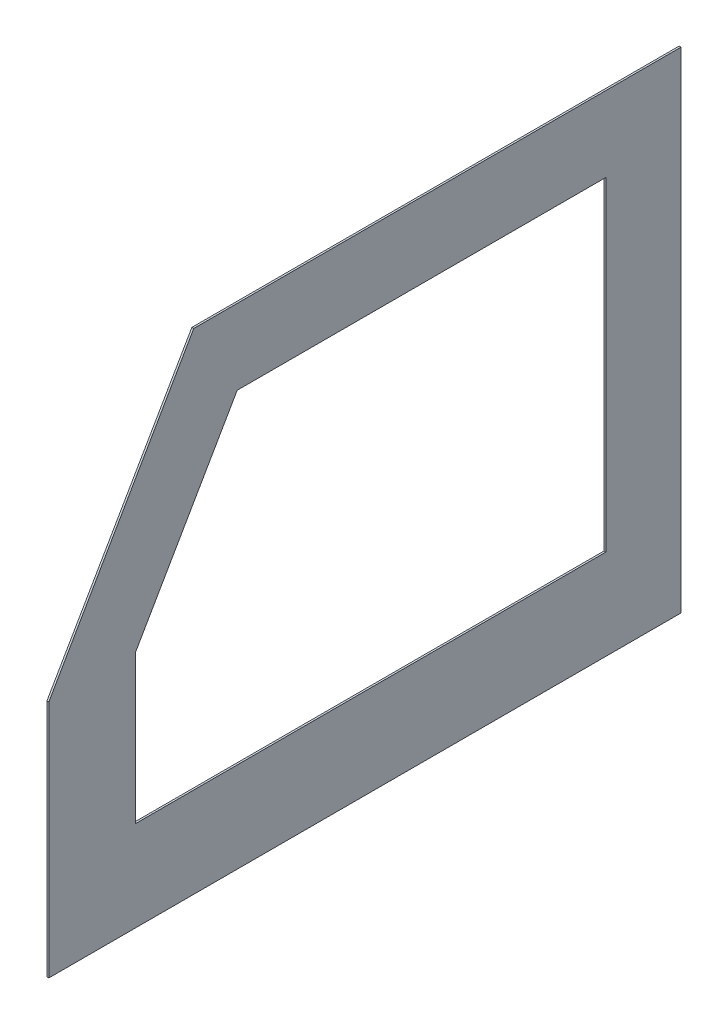
ISO-10303-21;
HEADER;
FILE_DESCRIPTION(('STEP AP214'),'2;1');
FILE_NAME('part.step','',(''),(''),'','','');
FILE_SCHEMA(('AUTOMOTIVE_DESIGN { 1 0 10303 214 1 1 1 1 }'));
ENDSEC;
DATA;
#1=APPLICATION_CONTEXT('core data for automotive mechanical design processes');
#2=APPLICATION_PROTOCOL_DEFINITION('international standard','automotive_design',2000,#1);
#3=PRODUCT_CONTEXT('',#1,'mechanical');
#4=PRODUCT('Part','Part','',(#3));
#5=PRODUCT_RELATED_PRODUCT_CATEGORY('part','',(#4));
#6=PRODUCT_DEFINITION_FORMATION('','',#4);
#7=PRODUCT_DEFINITION_CONTEXT('part definition',#1,'design');
#8=PRODUCT_DEFINITION('design','',#6,#7);
#9=PRODUCT_DEFINITION_SHAPE('','',#8);
#10=(LENGTH_UNIT() NAMED_UNIT(*) SI_UNIT(.MILLI.,.METRE.));
#11=(NAMED_UNIT(*) PLANE_ANGLE_UNIT() SI_UNIT($,.RADIAN.));
#12=(NAMED_UNIT(*) SI_UNIT($,.STERADIAN.) SOLID_ANGLE_UNIT());
#13=UNCERTAINTY_MEASURE_WITH_UNIT(LENGTH_MEASURE(1.E-05),#10,'distance_accuracy_value','');
#14=(GEOMETRIC_REPRESENTATION_CONTEXT(3) GLOBAL_UNCERTAINTY_ASSIGNED_CONTEXT((#13)) GLOBAL_UNIT_ASSIGNED_CONTEXT((#10,
#11,#12)) REPRESENTATION_CONTEXT('',''));
#15=CARTESIAN_POINT('',(0.,0.,0.));
#16=DIRECTION('',(0.,0.,1.));
#17=DIRECTION('',(1.,0.,0.));
#18=AXIS2_PLACEMENT_3D('',#15,#16,#17);
#19=CARTESIAN_POINT('',(3.175,-826.77,0.));
#20=DIRECTION('',(0.,0.,1.));
#21=DIRECTION('',(1.,0.,0.));
#22=AXIS2_PLACEMENT_3D('',#19,#20,#21);
#23=PLANE('',#22);
#24=DIRECTION('',(0.,1.,0.));
#25=VECTOR('',#24,1.);
#26=CARTESIAN_POINT('',(0.,-826.77,0.));
#27=LINE('',#26,#25);
#28=CARTESIAN_POINT('',(0.,-826.77,0.));
#29=VERTEX_POINT('',#28);
#30=CARTESIAN_POINT('',(0.,0.,0.));
#31=VERTEX_POINT('',#30);
#32=EDGE_CURVE('E123',#29,#31,#27,.T.);
#33=ORIENTED_EDGE('',*,*,#32,.T.);
#34=DIRECTION('',(-1.,0.,0.));
#35=VECTOR('',#34,1.);
#36=CARTESIAN_POINT('',(3.175,0.,0.));
#37=LINE('',#36,#35);
#38=CARTESIAN_POINT('',(3.175,0.,0.));
#39=VERTEX_POINT('',#38);
#40=EDGE_CURVE('E11',#39,#31,#37,.T.);
#41=ORIENTED_EDGE('',*,*,#40,.F.);
#42=DIRECTION('',(0.,1.,0.));
#43=VECTOR('',#42,1.);
#44=CARTESIAN_POINT('',(3.175,-826.77,0.));
#45=LINE('',#44,#43);
#46=CARTESIAN_POINT('',(3.175,-826.77,0.));
#47=VERTEX_POINT('',#46);
#48=EDGE_CURVE('E153',#47,#39,#45,.T.);
#49=ORIENTED_EDGE('',*,*,#48,.F.);
#50=DIRECTION('',(-1.,0.,0.));
#51=VECTOR('',#50,1.);
#52=CARTESIAN_POINT('',(3.175,-826.77,0.));
#53=LINE('',#52,#51);
#54=EDGE_CURVE('E165',#47,#29,#53,.T.);
#55=ORIENTED_EDGE('',*,*,#54,.T.);
#56=EDGE_LOOP('',(#33,#41,#49,#55));
#57=FACE_BOUND('',#56,.T.);
#58=ADVANCED_FACE('F33',(#57),#23,.F.);
#59=CARTESIAN_POINT('',(3.175,0.,0.));
#60=DIRECTION('',(0.,-1.,0.));
#61=DIRECTION('',(0.,0.,-1.));
#62=AXIS2_PLACEMENT_3D('',#59,#60,#61);
#63=PLANE('',#62);
#64=DIRECTION('',(0.,0.,1.));
#65=VECTOR('',#64,1.);
#66=CARTESIAN_POINT('',(0.,0.,0.));
#67=LINE('',#66,#65);
#68=CARTESIAN_POINT('',(0.,-1.00519503092861E-13,822.26618023608));
#69=VERTEX_POINT('',#68);
#70=EDGE_CURVE('E168',#31,#69,#67,.T.);
#71=ORIENTED_EDGE('',*,*,#70,.T.);
#72=DIRECTION('',(-1.,0.,0.));
#73=VECTOR('',#72,1.);
#74=CARTESIAN_POINT('',(3.175,-1.00519503092861E-13,822.26618023608));
#75=LINE('',#74,#73);
#76=CARTESIAN_POINT('',(3.175,-1.00519503092861E-13,822.26618023608));
#77=VERTEX_POINT('',#76);
#78=EDGE_CURVE('E40',#77,#69,#75,.T.);
#79=ORIENTED_EDGE('',*,*,#78,.F.);
#80=DIRECTION('',(0.,0.,1.));
#81=VECTOR('',#80,1.);
#82=CARTESIAN_POINT('',(3.175,0.,0.));
#83=LINE('',#82,#81);
#84=EDGE_CURVE('E156',#39,#77,#83,.T.);
#85=ORIENTED_EDGE('',*,*,#84,.F.);
#86=ORIENTED_EDGE('',*,*,#40,.T.);
#87=EDGE_LOOP('',(#71,#79,#85,#86));
#88=FACE_BOUND('',#87,.T.);
#89=ADVANCED_FACE('F205',(#88),#63,.F.);
#90=CARTESIAN_POINT('',(3.175,-1.00519503092861E-13,822.26618023608));
#91=DIRECTION('',(0.,-0.500000000000001,-0.866025403784438));
#92=DIRECTION('',(0.,0.866025403784438,-0.500000000000001));
#93=AXIS2_PLACEMENT_3D('',#90,#91,#92);
#94=PLANE('',#93);
#95=DIRECTION('',(0.,-0.866025403784438,0.500000000000001));
#96=VECTOR('',#95,1.);
#97=CARTESIAN_POINT('',(0.,-1.00519503092861E-13,822.26618023608));
#98=LINE('',#97,#96);
#99=CARTESIAN_POINT('',(0.,-423.545,1066.8));
#100=VERTEX_POINT('',#99);
#101=EDGE_CURVE('E170',#69,#100,#98,.T.);
#102=ORIENTED_EDGE('',*,*,#101,.T.);
#103=DIRECTION('',(-1.,0.,0.));
#104=VECTOR('',#103,1.);
#105=CARTESIAN_POINT('',(3.175,-423.545,1066.8));
#106=LINE('',#105,#104);
#107=CARTESIAN_POINT('',(3.175,-423.545,1066.8));
#108=VERTEX_POINT('',#107);
#109=EDGE_CURVE('E180',#108,#100,#106,.T.);
#110=ORIENTED_EDGE('',*,*,#109,.F.);
#111=DIRECTION('',(0.,-0.866025403784438,0.500000000000001));
#112=VECTOR('',#111,1.);
#113=CARTESIAN_POINT('',(3.175,-1.00519503092861E-13,822.26618023608));
#114=LINE('',#113,#112);
#115=EDGE_CURVE('E159',#77,#108,#114,.T.);
#116=ORIENTED_EDGE('',*,*,#115,.F.);
#117=ORIENTED_EDGE('',*,*,#78,.T.);
#118=EDGE_LOOP('',(#102,#110,#116,#117));
#119=FACE_BOUND('',#118,.T.);
#120=ADVANCED_FACE('F187',(#119),#94,.F.);
#121=CARTESIAN_POINT('',(3.175,-423.545,1066.8));
#122=DIRECTION('',(0.,0.,-1.));
#123=DIRECTION('',(-1.,0.,0.));
#124=AXIS2_PLACEMENT_3D('',#121,#122,#123);
#125=PLANE('',#124);
#126=DIRECTION('',(0.,-1.,0.));
#127=VECTOR('',#126,1.);
#128=CARTESIAN_POINT('',(0.,-423.545,1066.8));
#129=LINE('',#128,#127);
#130=CARTESIAN_POINT('',(0.,-826.77,1066.8));
#131=VERTEX_POINT('',#130);
#132=EDGE_CURVE('E172',#100,#131,#129,.T.);
#133=ORIENTED_EDGE('',*,*,#132,.T.);
#134=DIRECTION('',(-1.,0.,0.));
#135=VECTOR('',#134,1.);
#136=CARTESIAN_POINT('',(3.175,-826.77,1066.8));
#137=LINE('',#136,#135);
#138=CARTESIAN_POINT('',(3.175,-826.77,1066.8));
#139=VERTEX_POINT('',#138);
#140=EDGE_CURVE('E177',#139,#131,#137,.T.);
#141=ORIENTED_EDGE('',*,*,#140,.F.);
#142=DIRECTION('',(0.,-1.,0.));
#143=VECTOR('',#142,1.);
#144=CARTESIAN_POINT('',(3.175,-423.545,1066.8));
#145=LINE('',#144,#143);
#146=EDGE_CURVE('E161',#108,#139,#145,.T.);
#147=ORIENTED_EDGE('',*,*,#146,.F.);
#148=ORIENTED_EDGE('',*,*,#109,.T.);
#149=EDGE_LOOP('',(#133,#141,#147,#148));
#150=FACE_BOUND('',#149,.T.);
#151=ADVANCED_FACE('F195',(#150),#125,.F.);
#152=CARTESIAN_POINT('',(3.175,-826.77,1066.8));
#153=DIRECTION('',(0.,1.,0.));
#154=DIRECTION('',(0.,0.,1.));
#155=AXIS2_PLACEMENT_3D('',#152,#153,#154);
#156=PLANE('',#155);
#157=DIRECTION('',(0.,0.,-1.));
#158=VECTOR('',#157,1.);
#159=CARTESIAN_POINT('',(0.,-826.77,1066.8));
#160=LINE('',#159,#158);
#161=EDGE_CURVE('E157',#131,#29,#160,.T.);
#162=ORIENTED_EDGE('',*,*,#161,.T.);
#163=ORIENTED_EDGE('',*,*,#54,.F.);
#164=DIRECTION('',(0.,0.,-1.));
#165=VECTOR('',#164,1.);
#166=CARTESIAN_POINT('',(3.175,-826.77,1066.8));
#167=LINE('',#166,#165);
#168=EDGE_CURVE('E163',#139,#47,#167,.T.);
#169=ORIENTED_EDGE('',*,*,#168,.F.);
#170=ORIENTED_EDGE('',*,*,#140,.T.);
#171=EDGE_LOOP('',(#162,#163,#169,#170));
#172=FACE_BOUND('',#171,.T.);
#173=ADVANCED_FACE('F199',(#172),#156,.F.);
#174=CARTESIAN_POINT('',(3.175,0.,0.));
#175=DIRECTION('',(1.,0.,0.));
#176=DIRECTION('',(0.,0.,-1.));
#177=AXIS2_PLACEMENT_3D('',#174,#175,#176);
#178=PLANE('',#177);
#179=DIRECTION('',(0.,0.,1.));
#180=VECTOR('',#179,1.);
#181=CARTESIAN_POINT('',(3.175,-127.,127.));
#182=LINE('',#181,#180);
#183=CARTESIAN_POINT('',(3.175,-127.,127.));
#184=VERTEX_POINT('',#183);
#185=CARTESIAN_POINT('',(3.175,-127.,748.942696048997));
#186=VERTEX_POINT('',#185);
#187=EDGE_CURVE('E47',#184,#186,#182,.T.);
#188=ORIENTED_EDGE('',*,*,#187,.F.);
#189=DIRECTION('',(0.,1.,0.));
#190=VECTOR('',#189,1.);
#191=CARTESIAN_POINT('',(3.175,-423.545,127.));
#192=LINE('',#191,#190);
#193=CARTESIAN_POINT('',(3.175,-674.37,127.));
#194=VERTEX_POINT('',#193);
#195=EDGE_CURVE('E117',#194,#184,#192,.T.);
#196=ORIENTED_EDGE('',*,*,#195,.F.);
#197=DIRECTION('',(0.,0.,-1.));
#198=VECTOR('',#197,1.);
#199=CARTESIAN_POINT('',(3.175,-674.37,920.153031625835));
#200=LINE('',#199,#198);
#201=CARTESIAN_POINT('',(3.175,-674.37,920.153031625835));
#202=VERTEX_POINT('',#201);
#203=EDGE_CURVE('E142',#202,#194,#200,.T.);
#204=ORIENTED_EDGE('',*,*,#203,.F.);
#205=DIRECTION('',(0.,-1.,0.));
#206=VECTOR('',#205,1.);
#207=CARTESIAN_POINT('',(3.175,-423.545,920.153031625835));
#208=LINE('',#207,#206);
#209=CARTESIAN_POINT('',(3.175,-423.545,920.153031625835));
#210=VERTEX_POINT('',#209);
#211=EDGE_CURVE('E139',#210,#202,#208,.T.);
#212=ORIENTED_EDGE('',*,*,#211,.F.);
#213=DIRECTION('',(0.,-0.866025403784439,0.5));
#214=VECTOR('',#213,1.);
#215=CARTESIAN_POINT('',(3.175,-127.,748.942696048997));
#216=LINE('',#215,#214);
#217=EDGE_CURVE('E132',#186,#210,#216,.T.);
#218=ORIENTED_EDGE('',*,*,#217,.F.);
#219=EDGE_LOOP('',(#188,#196,#204,#212,#218));
#220=FACE_BOUND('',#219,.T.);
#221=ORIENTED_EDGE('',*,*,#48,.T.);
#222=ORIENTED_EDGE('',*,*,#84,.T.);
#223=ORIENTED_EDGE('',*,*,#115,.T.);
#224=ORIENTED_EDGE('',*,*,#146,.T.);
#225=ORIENTED_EDGE('',*,*,#168,.T.);
#226=EDGE_LOOP('',(#221,#222,#223,#224,#225));
#227=FACE_BOUND('',#226,.T.);
#228=ADVANCED_FACE('F203',(#220,#227),#178,.T.);
#229=CARTESIAN_POINT('',(0.,0.,0.));
#230=DIRECTION('',(1.,0.,0.));
#231=DIRECTION('',(0.,0.,-1.));
#232=AXIS2_PLACEMENT_3D('',#229,#230,#231);
#233=PLANE('',#232);
#234=DIRECTION('',(0.,-1.,0.));
#235=VECTOR('',#234,1.);
#236=CARTESIAN_POINT('',(0.,-423.545,127.));
#237=LINE('',#236,#235);
#238=CARTESIAN_POINT('',(0.,-127.,127.));
#239=VERTEX_POINT('',#238);
#240=CARTESIAN_POINT('',(0.,-674.37,127.));
#241=VERTEX_POINT('',#240);
#242=EDGE_CURVE('E130',#239,#241,#237,.T.);
#243=ORIENTED_EDGE('',*,*,#242,.F.);
#244=DIRECTION('',(0.,0.,-1.));
#245=VECTOR('',#244,1.);
#246=CARTESIAN_POINT('',(0.,-127.,127.));
#247=LINE('',#246,#245);
#248=CARTESIAN_POINT('',(0.,-127.,748.942696048997));
#249=VERTEX_POINT('',#248);
#250=EDGE_CURVE('E111',#249,#239,#247,.T.);
#251=ORIENTED_EDGE('',*,*,#250,.F.);
#252=DIRECTION('',(0.,0.866025403784439,-0.5));
#253=VECTOR('',#252,1.);
#254=CARTESIAN_POINT('',(0.,-127.,748.942696048997));
#255=LINE('',#254,#253);
#256=CARTESIAN_POINT('',(0.,-423.545,920.153031625835));
#257=VERTEX_POINT('',#256);
#258=EDGE_CURVE('E120',#257,#249,#255,.T.);
#259=ORIENTED_EDGE('',*,*,#258,.F.);
#260=DIRECTION('',(0.,1.,0.));
#261=VECTOR('',#260,1.);
#262=CARTESIAN_POINT('',(0.,-423.545,920.153031625835));
#263=LINE('',#262,#261);
#264=CARTESIAN_POINT('',(0.,-674.37,920.153031625835));
#265=VERTEX_POINT('',#264);
#266=EDGE_CURVE('E55',#265,#257,#263,.T.);
#267=ORIENTED_EDGE('',*,*,#266,.F.);
#268=DIRECTION('',(0.,0.,1.));
#269=VECTOR('',#268,1.);
#270=CARTESIAN_POINT('',(0.,-674.37,920.153031625835));
#271=LINE('',#270,#269);
#272=EDGE_CURVE('E134',#241,#265,#271,.T.);
#273=ORIENTED_EDGE('',*,*,#272,.F.);
#274=EDGE_LOOP('',(#243,#251,#259,#267,#273));
#275=FACE_BOUND('',#274,.T.);
#276=ORIENTED_EDGE('',*,*,#32,.F.);
#277=ORIENTED_EDGE('',*,*,#161,.F.);
#278=ORIENTED_EDGE('',*,*,#132,.F.);
#279=ORIENTED_EDGE('',*,*,#101,.F.);
#280=ORIENTED_EDGE('',*,*,#70,.F.);
#281=EDGE_LOOP('',(#276,#277,#278,#279,#280));
#282=FACE_BOUND('',#281,.T.);
#283=ADVANCED_FACE('F126',(#275,#282),#233,.F.);
#284=CARTESIAN_POINT('',(-0.00100000000000013,-127.,127.));
#285=DIRECTION('',(0.,1.,0.));
#286=DIRECTION('',(0.,0.,1.));
#287=AXIS2_PLACEMENT_3D('',#284,#285,#286);
#288=PLANE('',#287);
#289=ORIENTED_EDGE('',*,*,#250,.T.);
#290=DIRECTION('',(1.,0.,0.));
#291=VECTOR('',#290,1.);
#292=CARTESIAN_POINT('',(-0.00100000000000013,-127.,127.));
#293=LINE('',#292,#291);
#294=EDGE_CURVE('E124',#239,#184,#293,.T.);
#295=ORIENTED_EDGE('',*,*,#294,.T.);
#296=ORIENTED_EDGE('',*,*,#187,.T.);
#297=DIRECTION('',(1.,0.,0.));
#298=VECTOR('',#297,1.);
#299=CARTESIAN_POINT('',(-0.00100000000000013,-127.,748.942696048997));
#300=LINE('',#299,#298);
#301=EDGE_CURVE('E107',#249,#186,#300,.T.);
#302=ORIENTED_EDGE('',*,*,#301,.F.);
#303=EDGE_LOOP('',(#289,#295,#296,#302));
#304=FACE_BOUND('',#303,.T.);
#305=ADVANCED_FACE('F109',(#304),#288,.F.);
#306=CARTESIAN_POINT('',(-0.00100000000000013,-423.545,127.));
#307=DIRECTION('',(0.,0.,-1.));
#308=DIRECTION('',(-1.,0.,0.));
#309=AXIS2_PLACEMENT_3D('',#306,#307,#308);
#310=PLANE('',#309);
#311=ORIENTED_EDGE('',*,*,#242,.T.);
#312=DIRECTION('',(1.,0.,0.));
#313=VECTOR('',#312,1.);
#314=CARTESIAN_POINT('',(-0.00100000000000013,-674.37,127.));
#315=LINE('',#314,#313);
#316=EDGE_CURVE('E148',#241,#194,#315,.T.);
#317=ORIENTED_EDGE('',*,*,#316,.T.);
#318=ORIENTED_EDGE('',*,*,#195,.T.);
#319=ORIENTED_EDGE('',*,*,#294,.F.);
#320=EDGE_LOOP('',(#311,#317,#318,#319));
#321=FACE_BOUND('',#320,.T.);
#322=ADVANCED_FACE('F227',(#321),#310,.F.);
#323=CARTESIAN_POINT('',(-0.00100000000000013,-674.37,920.153031625835));
#324=DIRECTION('',(0.,-1.,0.));
#325=DIRECTION('',(0.,0.,-1.));
#326=AXIS2_PLACEMENT_3D('',#323,#324,#325);
#327=PLANE('',#326);
#328=ORIENTED_EDGE('',*,*,#272,.T.);
#329=DIRECTION('',(1.,0.,0.));
#330=VECTOR('',#329,1.);
#331=CARTESIAN_POINT('',(-0.00100000000000013,-674.37,920.153031625835));
#332=LINE('',#331,#330);
#333=EDGE_CURVE('E150',#265,#202,#332,.T.);
#334=ORIENTED_EDGE('',*,*,#333,.T.);
#335=ORIENTED_EDGE('',*,*,#203,.T.);
#336=ORIENTED_EDGE('',*,*,#316,.F.);
#337=EDGE_LOOP('',(#328,#334,#335,#336));
#338=FACE_BOUND('',#337,.T.);
#339=ADVANCED_FACE('F233',(#338),#327,.F.);
#340=CARTESIAN_POINT('',(-0.00100000000000013,-423.545,920.153031625835));
#341=DIRECTION('',(0.,0.,1.));
#342=DIRECTION('',(0.,-1.,0.));
#343=AXIS2_PLACEMENT_3D('',#340,#341,#342);
#344=PLANE('',#343);
#345=ORIENTED_EDGE('',*,*,#266,.T.);
#346=DIRECTION('',(1.,0.,0.));
#347=VECTOR('',#346,1.);
#348=CARTESIAN_POINT('',(-0.00100000000000013,-423.545,920.153031625835));
#349=LINE('',#348,#347);
#350=EDGE_CURVE('E116',#257,#210,#349,.T.);
#351=ORIENTED_EDGE('',*,*,#350,.T.);
#352=ORIENTED_EDGE('',*,*,#211,.T.);
#353=ORIENTED_EDGE('',*,*,#333,.F.);
#354=EDGE_LOOP('',(#345,#351,#352,#353));
#355=FACE_BOUND('',#354,.T.);
#356=ADVANCED_FACE('F230',(#355),#344,.F.);
#357=CARTESIAN_POINT('',(-0.00100000000000013,-127.,748.942696048997));
#358=DIRECTION('',(0.,0.5,0.866025403784439));
#359=DIRECTION('',(0.,-0.866025403784439,0.5));
#360=AXIS2_PLACEMENT_3D('',#357,#358,#359);
#361=PLANE('',#360);
#362=ORIENTED_EDGE('',*,*,#258,.T.);
#363=ORIENTED_EDGE('',*,*,#301,.T.);
#364=ORIENTED_EDGE('',*,*,#217,.T.);
#365=ORIENTED_EDGE('',*,*,#350,.F.);
#366=EDGE_LOOP('',(#362,#363,#364,#365));
#367=FACE_BOUND('',#366,.T.);
#368=ADVANCED_FACE('F121',(#367),#361,.F.);
#369=CLOSED_SHELL('',(#58,#89,#120,#151,#173,#228,#283,#305,#322,#339,#356,#368));
#370=MANIFOLD_SOLID_BREP('B2',#369);
#371=ADVANCED_BREP_SHAPE_REPRESENTATION('',(#18,#370),#14);
#372=SHAPE_DEFINITION_REPRESENTATION(#9,#371);
ENDSEC;
END-ISO-10303-21;
